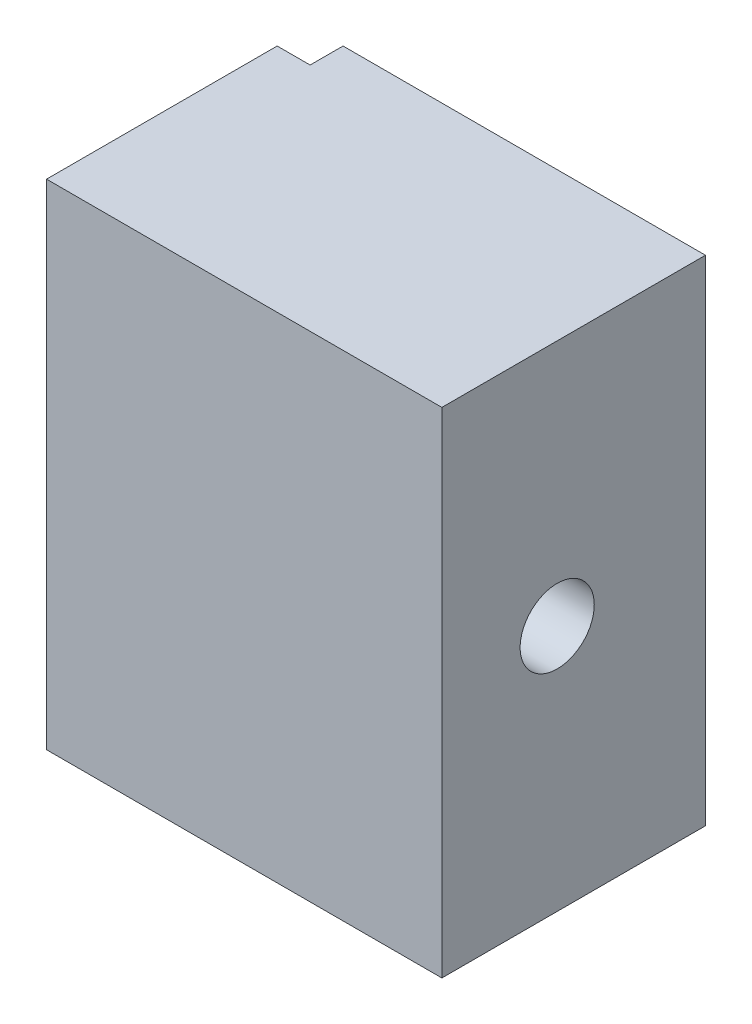
ISO-10303-21;
HEADER;
FILE_DESCRIPTION(('STEP AP214'),'2;1');
FILE_NAME('part.step','',(''),(''),'','','');
FILE_SCHEMA(('AUTOMOTIVE_DESIGN { 1 0 10303 214 1 1 1 1 }'));
ENDSEC;
DATA;
#1=APPLICATION_CONTEXT('core data for automotive mechanical design processes');
#2=APPLICATION_PROTOCOL_DEFINITION('international standard','automotive_design',2000,#1);
#3=PRODUCT_CONTEXT('',#1,'mechanical');
#4=PRODUCT('Part','Part','',(#3));
#5=PRODUCT_RELATED_PRODUCT_CATEGORY('part','',(#4));
#6=PRODUCT_DEFINITION_FORMATION('','',#4);
#7=PRODUCT_DEFINITION_CONTEXT('part definition',#1,'design');
#8=PRODUCT_DEFINITION('design','',#6,#7);
#9=PRODUCT_DEFINITION_SHAPE('','',#8);
#10=(LENGTH_UNIT() NAMED_UNIT(*) SI_UNIT(.MILLI.,.METRE.));
#11=(NAMED_UNIT(*) PLANE_ANGLE_UNIT() SI_UNIT($,.RADIAN.));
#12=(NAMED_UNIT(*) SI_UNIT($,.STERADIAN.) SOLID_ANGLE_UNIT());
#13=UNCERTAINTY_MEASURE_WITH_UNIT(LENGTH_MEASURE(1.E-05),#10,'distance_accuracy_value','');
#14=(GEOMETRIC_REPRESENTATION_CONTEXT(3) GLOBAL_UNCERTAINTY_ASSIGNED_CONTEXT((#13)) GLOBAL_UNIT_ASSIGNED_CONTEXT((#10,
#11,#12)) REPRESENTATION_CONTEXT('',''));
#15=CARTESIAN_POINT('',(0.,0.,0.));
#16=DIRECTION('',(0.,0.,1.));
#17=DIRECTION('',(1.,0.,0.));
#18=AXIS2_PLACEMENT_3D('',#15,#16,#17);
#19=CARTESIAN_POINT('',(24.,0.,0.));
#20=DIRECTION('',(0.,0.,1.));
#21=DIRECTION('',(1.,0.,0.));
#22=AXIS2_PLACEMENT_3D('',#19,#20,#21);
#23=PLANE('',#22);
#24=DIRECTION('',(0.,-1.,0.));
#25=VECTOR('',#24,1.);
#26=CARTESIAN_POINT('',(2.,30.,0.));
#27=LINE('',#26,#25);
#28=CARTESIAN_POINT('',(2.,30.,0.));
#29=VERTEX_POINT('',#28);
#30=CARTESIAN_POINT('',(2.,0.,0.));
#31=VERTEX_POINT('',#30);
#32=EDGE_CURVE('E96',#29,#31,#27,.T.);
#33=ORIENTED_EDGE('',*,*,#32,.F.);
#34=DIRECTION('',(-1.,0.,0.));
#35=VECTOR('',#34,1.);
#36=CARTESIAN_POINT('',(24.,30.,0.));
#37=LINE('',#36,#35);
#38=CARTESIAN_POINT('',(24.,30.,0.));
#39=VERTEX_POINT('',#38);
#40=EDGE_CURVE('E11',#39,#29,#37,.T.);
#41=ORIENTED_EDGE('',*,*,#40,.F.);
#42=DIRECTION('',(0.,1.,0.));
#43=VECTOR('',#42,1.);
#44=CARTESIAN_POINT('',(24.,0.,0.));
#45=LINE('',#44,#43);
#46=CARTESIAN_POINT('',(24.,0.,0.));
#47=VERTEX_POINT('',#46);
#48=EDGE_CURVE('E115',#47,#39,#45,.T.);
#49=ORIENTED_EDGE('',*,*,#48,.F.);
#50=DIRECTION('',(-1.,0.,0.));
#51=VECTOR('',#50,1.);
#52=CARTESIAN_POINT('',(24.,0.,0.));
#53=LINE('',#52,#51);
#54=EDGE_CURVE('E111',#47,#31,#53,.T.);
#55=ORIENTED_EDGE('',*,*,#54,.T.);
#56=EDGE_LOOP('',(#33,#41,#49,#55));
#57=FACE_BOUND('',#56,.T.);
#58=ADVANCED_FACE('F34',(#57),#23,.F.);
#59=CARTESIAN_POINT('',(24.,30.,0.));
#60=DIRECTION('',(0.,-1.,0.));
#61=DIRECTION('',(0.,0.,-1.));
#62=AXIS2_PLACEMENT_3D('',#59,#60,#61);
#63=PLANE('',#62);
#64=DIRECTION('',(0.,0.,-1.));
#65=VECTOR('',#64,1.);
#66=CARTESIAN_POINT('',(2.,30.,0.));
#67=LINE('',#66,#65);
#68=CARTESIAN_POINT('',(2.,30.,2.));
#69=VERTEX_POINT('',#68);
#70=EDGE_CURVE('E102',#69,#29,#67,.T.);
#71=ORIENTED_EDGE('',*,*,#70,.F.);
#72=DIRECTION('',(-1.,0.,0.));
#73=VECTOR('',#72,1.);
#74=CARTESIAN_POINT('',(2.,30.,2.));
#75=LINE('',#74,#73);
#76=CARTESIAN_POINT('',(0.,30.,2.));
#77=VERTEX_POINT('',#76);
#78=EDGE_CURVE('E131',#69,#77,#75,.T.);
#79=ORIENTED_EDGE('',*,*,#78,.T.);
#80=DIRECTION('',(0.,0.,1.));
#81=VECTOR('',#80,1.);
#82=CARTESIAN_POINT('',(0.,30.,0.));
#83=LINE('',#82,#81);
#84=CARTESIAN_POINT('',(0.,30.,16.));
#85=VERTEX_POINT('',#84);
#86=EDGE_CURVE('E130',#77,#85,#83,.T.);
#87=ORIENTED_EDGE('',*,*,#86,.T.);
#88=DIRECTION('',(-1.,0.,0.));
#89=VECTOR('',#88,1.);
#90=CARTESIAN_POINT('',(24.,30.,16.));
#91=LINE('',#90,#89);
#92=CARTESIAN_POINT('',(24.,30.,16.));
#93=VERTEX_POINT('',#92);
#94=EDGE_CURVE('E41',#93,#85,#91,.T.);
#95=ORIENTED_EDGE('',*,*,#94,.F.);
#96=DIRECTION('',(0.,0.,1.));
#97=VECTOR('',#96,1.);
#98=CARTESIAN_POINT('',(24.,30.,0.));
#99=LINE('',#98,#97);
#100=EDGE_CURVE('E80',#39,#93,#99,.T.);
#101=ORIENTED_EDGE('',*,*,#100,.F.);
#102=ORIENTED_EDGE('',*,*,#40,.T.);
#103=EDGE_LOOP('',(#71,#79,#87,#95,#101,#102));
#104=FACE_BOUND('',#103,.T.);
#105=ADVANCED_FACE('F155',(#104),#63,.F.);
#106=CARTESIAN_POINT('',(24.,0.,16.));
#107=DIRECTION('',(0.,0.,-1.));
#108=DIRECTION('',(0.,1.,0.));
#109=AXIS2_PLACEMENT_3D('',#106,#107,#108);
#110=PLANE('',#109);
#111=DIRECTION('',(0.,-1.,0.));
#112=VECTOR('',#111,1.);
#113=CARTESIAN_POINT('',(0.,0.,16.));
#114=LINE('',#113,#112);
#115=CARTESIAN_POINT('',(0.,0.,16.));
#116=VERTEX_POINT('',#115);
#117=EDGE_CURVE('E73',#85,#116,#114,.T.);
#118=ORIENTED_EDGE('',*,*,#117,.T.);
#119=DIRECTION('',(-1.,0.,0.));
#120=VECTOR('',#119,1.);
#121=CARTESIAN_POINT('',(24.,0.,16.));
#122=LINE('',#121,#120);
#123=CARTESIAN_POINT('',(24.,0.,16.));
#124=VERTEX_POINT('',#123);
#125=EDGE_CURVE('E116',#124,#116,#122,.T.);
#126=ORIENTED_EDGE('',*,*,#125,.F.);
#127=DIRECTION('',(0.,-1.,0.));
#128=VECTOR('',#127,1.);
#129=CARTESIAN_POINT('',(24.,0.,16.));
#130=LINE('',#129,#128);
#131=EDGE_CURVE('E119',#93,#124,#130,.T.);
#132=ORIENTED_EDGE('',*,*,#131,.F.);
#133=ORIENTED_EDGE('',*,*,#94,.T.);
#134=EDGE_LOOP('',(#118,#126,#132,#133));
#135=FACE_BOUND('',#134,.T.);
#136=ADVANCED_FACE('F125',(#135),#110,.F.);
#137=CARTESIAN_POINT('',(24.,0.,0.));
#138=DIRECTION('',(0.,1.,0.));
#139=DIRECTION('',(0.,0.,1.));
#140=AXIS2_PLACEMENT_3D('',#137,#138,#139);
#141=PLANE('',#140);
#142=DIRECTION('',(0.,0.,-1.));
#143=VECTOR('',#142,1.);
#144=CARTESIAN_POINT('',(0.,0.,0.));
#145=LINE('',#144,#143);
#146=CARTESIAN_POINT('',(0.,0.,2.));
#147=VERTEX_POINT('',#146);
#148=EDGE_CURVE('E122',#116,#147,#145,.T.);
#149=ORIENTED_EDGE('',*,*,#148,.T.);
#150=DIRECTION('',(-1.,0.,0.));
#151=VECTOR('',#150,1.);
#152=CARTESIAN_POINT('',(2.,0.,2.));
#153=LINE('',#152,#151);
#154=CARTESIAN_POINT('',(2.,0.,2.));
#155=VERTEX_POINT('',#154);
#156=EDGE_CURVE('E48',#155,#147,#153,.T.);
#157=ORIENTED_EDGE('',*,*,#156,.F.);
#158=DIRECTION('',(0.,0.,1.));
#159=VECTOR('',#158,1.);
#160=CARTESIAN_POINT('',(2.,0.,0.));
#161=LINE('',#160,#159);
#162=EDGE_CURVE('E100',#31,#155,#161,.T.);
#163=ORIENTED_EDGE('',*,*,#162,.F.);
#164=ORIENTED_EDGE('',*,*,#54,.F.);
#165=DIRECTION('',(0.,0.,-1.));
#166=VECTOR('',#165,1.);
#167=CARTESIAN_POINT('',(24.,0.,0.));
#168=LINE('',#167,#166);
#169=EDGE_CURVE('E57',#124,#47,#168,.T.);
#170=ORIENTED_EDGE('',*,*,#169,.F.);
#171=ORIENTED_EDGE('',*,*,#125,.T.);
#172=EDGE_LOOP('',(#149,#157,#163,#164,#170,#171));
#173=FACE_BOUND('',#172,.T.);
#174=ADVANCED_FACE('F110',(#173),#141,.F.);
#175=CARTESIAN_POINT('',(24.,0.,0.));
#176=DIRECTION('',(1.,0.,0.));
#177=DIRECTION('',(0.,0.,-1.));
#178=AXIS2_PLACEMENT_3D('',#175,#176,#177);
#179=PLANE('',#178);
#180=CARTESIAN_POINT('',(24.,15.,9.));
#181=DIRECTION('',(1.,0.,0.));
#182=DIRECTION('',(0.,0.,-1.));
#183=AXIS2_PLACEMENT_3D('',#180,#181,#182);
#184=CIRCLE('',#183,2.24999999999999);
#185=CARTESIAN_POINT('',(24.,15.,6.75000000000001));
#186=VERTEX_POINT('',#185);
#187=EDGE_CURVE('E146',#186,#186,#184,.T.);
#188=ORIENTED_EDGE('',*,*,#187,.F.);
#189=EDGE_LOOP('',(#188));
#190=FACE_BOUND('',#189,.T.);
#191=ORIENTED_EDGE('',*,*,#48,.T.);
#192=ORIENTED_EDGE('',*,*,#100,.T.);
#193=ORIENTED_EDGE('',*,*,#131,.T.);
#194=ORIENTED_EDGE('',*,*,#169,.T.);
#195=EDGE_LOOP('',(#191,#192,#193,#194));
#196=FACE_BOUND('',#195,.T.);
#197=ADVANCED_FACE('F152',(#190,#196),#179,.T.);
#198=CARTESIAN_POINT('',(0.,0.,0.));
#199=DIRECTION('',(1.,0.,0.));
#200=DIRECTION('',(0.,0.,-1.));
#201=AXIS2_PLACEMENT_3D('',#198,#199,#200);
#202=PLANE('',#201);
#203=CARTESIAN_POINT('',(0.,15.,9.));
#204=DIRECTION('',(1.,0.,0.));
#205=DIRECTION('',(0.,0.,-1.));
#206=AXIS2_PLACEMENT_3D('',#203,#204,#205);
#207=CIRCLE('',#206,2.25);
#208=CARTESIAN_POINT('',(0.,15.,6.75));
#209=VERTEX_POINT('',#208);
#210=EDGE_CURVE('E141',#209,#209,#207,.T.);
#211=ORIENTED_EDGE('',*,*,#210,.T.);
#212=EDGE_LOOP('',(#211));
#213=FACE_BOUND('',#212,.T.);
#214=ORIENTED_EDGE('',*,*,#86,.F.);
#215=DIRECTION('',(0.,1.,0.));
#216=VECTOR('',#215,1.);
#217=CARTESIAN_POINT('',(0.,30.,2.));
#218=LINE('',#217,#216);
#219=EDGE_CURVE('E106',#147,#77,#218,.T.);
#220=ORIENTED_EDGE('',*,*,#219,.F.);
#221=ORIENTED_EDGE('',*,*,#148,.F.);
#222=ORIENTED_EDGE('',*,*,#117,.F.);
#223=EDGE_LOOP('',(#214,#220,#221,#222));
#224=FACE_BOUND('',#223,.T.);
#225=ADVANCED_FACE('F129',(#213,#224),#202,.F.);
#226=CARTESIAN_POINT('',(2.,30.,2.));
#227=DIRECTION('',(0.,0.,1.));
#228=DIRECTION('',(0.,-1.,0.));
#229=AXIS2_PLACEMENT_3D('',#226,#227,#228);
#230=PLANE('',#229);
#231=ORIENTED_EDGE('',*,*,#219,.T.);
#232=ORIENTED_EDGE('',*,*,#78,.F.);
#233=DIRECTION('',(0.,1.,0.));
#234=VECTOR('',#233,1.);
#235=CARTESIAN_POINT('',(2.,30.,2.));
#236=LINE('',#235,#234);
#237=EDGE_CURVE('E113',#155,#69,#236,.T.);
#238=ORIENTED_EDGE('',*,*,#237,.F.);
#239=ORIENTED_EDGE('',*,*,#156,.T.);
#240=EDGE_LOOP('',(#231,#232,#238,#239));
#241=FACE_BOUND('',#240,.T.);
#242=ADVANCED_FACE('F156',(#241),#230,.F.);
#243=CARTESIAN_POINT('',(2.,0.,0.));
#244=DIRECTION('',(-1.,0.,0.));
#245=DIRECTION('',(0.,0.,1.));
#246=AXIS2_PLACEMENT_3D('',#243,#244,#245);
#247=PLANE('',#246);
#248=ORIENTED_EDGE('',*,*,#32,.T.);
#249=ORIENTED_EDGE('',*,*,#162,.T.);
#250=ORIENTED_EDGE('',*,*,#237,.T.);
#251=ORIENTED_EDGE('',*,*,#70,.T.);
#252=EDGE_LOOP('',(#248,#249,#250,#251));
#253=FACE_BOUND('',#252,.T.);
#254=ADVANCED_FACE('F98',(#253),#247,.T.);
#255=CARTESIAN_POINT('',(24.,15.,9.));
#256=DIRECTION('',(1.,0.,0.));
#257=DIRECTION('',(0.,0.,-1.));
#258=AXIS2_PLACEMENT_3D('',#255,#256,#257);
#259=CYLINDRICAL_SURFACE('',#258,2.24999999999999);
#260=ORIENTED_EDGE('',*,*,#210,.F.);
#261=EDGE_LOOP('',(#260));
#262=FACE_BOUND('',#261,.T.);
#263=ORIENTED_EDGE('',*,*,#187,.T.);
#264=EDGE_LOOP('',(#263));
#265=FACE_BOUND('',#264,.T.);
#266=ADVANCED_FACE('F150',(#262,#265),#259,.F.);
#267=CLOSED_SHELL('',(#58,#105,#136,#174,#197,#225,#242,#254,#266));
#268=MANIFOLD_SOLID_BREP('B2',#267);
#269=ADVANCED_BREP_SHAPE_REPRESENTATION('',(#18,#268),#14);
#270=SHAPE_DEFINITION_REPRESENTATION(#9,#269);
ENDSEC;
END-ISO-10303-21;
